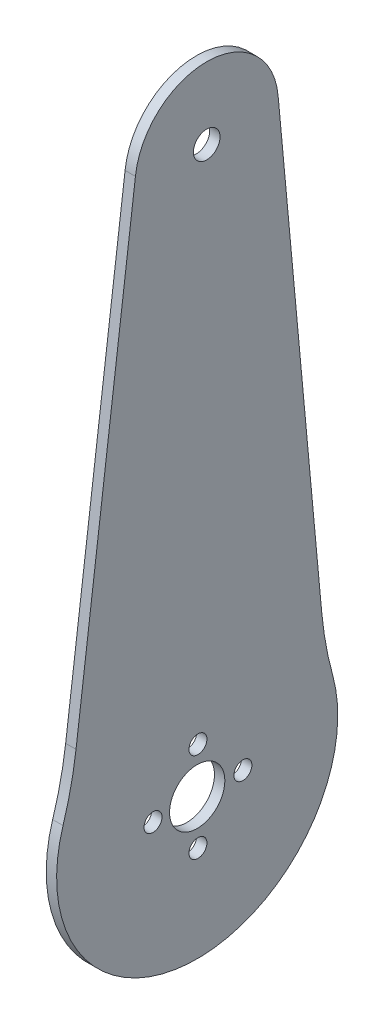
ISO-10303-21;
HEADER;
FILE_DESCRIPTION(('STEP AP214'),'2;1');
FILE_NAME('part.step','',(''),(''),'','','');
FILE_SCHEMA(('AUTOMOTIVE_DESIGN { 1 0 10303 214 1 1 1 1 }'));
ENDSEC;
DATA;
#1=APPLICATION_CONTEXT('core data for automotive mechanical design processes');
#2=APPLICATION_PROTOCOL_DEFINITION('international standard','automotive_design',2000,#1);
#3=PRODUCT_CONTEXT('',#1,'mechanical');
#4=PRODUCT('Part','Part','',(#3));
#5=PRODUCT_RELATED_PRODUCT_CATEGORY('part','',(#4));
#6=PRODUCT_DEFINITION_FORMATION('','',#4);
#7=PRODUCT_DEFINITION_CONTEXT('part definition',#1,'design');
#8=PRODUCT_DEFINITION('design','',#6,#7);
#9=PRODUCT_DEFINITION_SHAPE('','',#8);
#10=(LENGTH_UNIT() NAMED_UNIT(*) SI_UNIT(.MILLI.,.METRE.));
#11=(NAMED_UNIT(*) PLANE_ANGLE_UNIT() SI_UNIT($,.RADIAN.));
#12=(NAMED_UNIT(*) SI_UNIT($,.STERADIAN.) SOLID_ANGLE_UNIT());
#13=UNCERTAINTY_MEASURE_WITH_UNIT(LENGTH_MEASURE(1.E-05),#10,'distance_accuracy_value','');
#14=(GEOMETRIC_REPRESENTATION_CONTEXT(3) GLOBAL_UNCERTAINTY_ASSIGNED_CONTEXT((#13)) GLOBAL_UNIT_ASSIGNED_CONTEXT((#10,
#11,#12)) REPRESENTATION_CONTEXT('',''));
#15=CARTESIAN_POINT('',(0.,0.,0.));
#16=DIRECTION('',(0.,0.,1.));
#17=DIRECTION('',(1.,0.,0.));
#18=AXIS2_PLACEMENT_3D('',#15,#16,#17);
#19=CARTESIAN_POINT('',(1.5,-14.5197265267647,67.1222965585789));
#20=DIRECTION('',(-1.,0.,0.));
#21=DIRECTION('',(0.,0.,1.));
#22=AXIS2_PLACEMENT_3D('',#19,#20,#21);
#23=CYLINDRICAL_SURFACE('',#22,50.);
#24=CARTESIAN_POINT('',(0.,-14.5197265267647,67.1222965585789));
#25=DIRECTION('',(1.,0.,0.));
#26=DIRECTION('',(0.,0.,-1.));
#27=AXIS2_PLACEMENT_3D('',#24,#25,#26);
#28=CIRCLE('',#27,50.);
#29=CARTESIAN_POINT('',(0.,-29.4464687082596,19.4023597622337));
#30=VERTEX_POINT('',#29);
#31=CARTESIAN_POINT('',(0.,-20.8371614377476,17.5230020460004));
#32=VERTEX_POINT('',#31);
#33=EDGE_CURVE('E135',#30,#32,#28,.T.);
#34=ORIENTED_EDGE('',*,*,#33,.F.);
#35=DIRECTION('',(-1.,0.,0.));
#36=VECTOR('',#35,1.);
#37=CARTESIAN_POINT('',(1.5,-29.4464687082596,19.4023597622337));
#38=LINE('',#37,#36);
#39=CARTESIAN_POINT('',(1.5,-29.4464687082596,19.4023597622337));
#40=VERTEX_POINT('',#39);
#41=EDGE_CURVE('E11',#40,#30,#38,.T.);
#42=ORIENTED_EDGE('',*,*,#41,.F.);
#43=CARTESIAN_POINT('',(1.5,-14.5197265267647,67.1222965585789));
#44=DIRECTION('',(1.,0.,0.));
#45=DIRECTION('',(0.,0.,-1.));
#46=AXIS2_PLACEMENT_3D('',#43,#44,#45);
#47=CIRCLE('',#46,50.);
#48=CARTESIAN_POINT('',(1.5,-20.8371614377476,17.5230020460004));
#49=VERTEX_POINT('',#48);
#50=EDGE_CURVE('E166',#40,#49,#47,.T.);
#51=ORIENTED_EDGE('',*,*,#50,.T.);
#52=DIRECTION('',(-1.,0.,0.));
#53=VECTOR('',#52,1.);
#54=CARTESIAN_POINT('',(1.5,-20.8371614377476,17.5230020460004));
#55=LINE('',#54,#53);
#56=EDGE_CURVE('E78',#49,#32,#55,.T.);
#57=ORIENTED_EDGE('',*,*,#56,.T.);
#58=EDGE_LOOP('',(#34,#42,#51,#57));
#59=FACE_BOUND('',#58,.T.);
#60=ADVANCED_FACE('F34',(#59),#23,.F.);
#61=CARTESIAN_POINT('',(1.5,-35.5155048664515,0.));
#62=DIRECTION('',(-1.,0.,0.));
#63=DIRECTION('',(0.,0.,1.));
#64=AXIS2_PLACEMENT_3D('',#61,#62,#63);
#65=CYLINDRICAL_SURFACE('',#64,20.3294063915449);
#66=CARTESIAN_POINT('',(0.,-35.5155048664515,0.));
#67=DIRECTION('',(1.,0.,0.));
#68=DIRECTION('',(0.,0.,-1.));
#69=AXIS2_PLACEMENT_3D('',#66,#67,#68);
#70=CIRCLE('',#69,20.3294063915449);
#71=CARTESIAN_POINT('',(0.,-30.1098500353034,-19.5975421948537));
#72=VERTEX_POINT('',#71);
#73=EDGE_CURVE('E138',#30,#72,#70,.T.);
#74=ORIENTED_EDGE('',*,*,#73,.T.);
#75=DIRECTION('',(-1.,0.,0.));
#76=VECTOR('',#75,1.);
#77=CARTESIAN_POINT('',(1.5,-30.1098500353034,-19.5975421948537));
#78=LINE('',#77,#76);
#79=CARTESIAN_POINT('',(1.5,-30.1098500353034,-19.5975421948537));
#80=VERTEX_POINT('',#79);
#81=EDGE_CURVE('E42',#80,#72,#78,.T.);
#82=ORIENTED_EDGE('',*,*,#81,.F.);
#83=CARTESIAN_POINT('',(1.5,-35.5155048664515,0.));
#84=DIRECTION('',(1.,0.,0.));
#85=DIRECTION('',(0.,0.,-1.));
#86=AXIS2_PLACEMENT_3D('',#83,#84,#85);
#87=CIRCLE('',#86,20.3294063915449);
#88=EDGE_CURVE('E112',#40,#80,#87,.T.);
#89=ORIENTED_EDGE('',*,*,#88,.F.);
#90=ORIENTED_EDGE('',*,*,#41,.T.);
#91=EDGE_LOOP('',(#74,#82,#89,#90));
#92=FACE_BOUND('',#91,.T.);
#93=ADVANCED_FACE('F175',(#92),#65,.T.);
#94=CARTESIAN_POINT('',(1.5,-16.8146885164819,-67.7975285038606));
#95=DIRECTION('',(-1.,0.,0.));
#96=DIRECTION('',(0.,0.,1.));
#97=AXIS2_PLACEMENT_3D('',#94,#95,#96);
#98=CYLINDRICAL_SURFACE('',#97,50.);
#99=CARTESIAN_POINT('',(0.,-16.8146885164819,-67.7975285038606));
#100=DIRECTION('',(1.,0.,0.));
#101=DIRECTION('',(0.,0.,-1.));
#102=AXIS2_PLACEMENT_3D('',#99,#100,#101);
#103=CIRCLE('',#102,50.);
#104=CARTESIAN_POINT('',(0.,-21.4416066730812,-18.0120725114512));
#105=VERTEX_POINT('',#104);
#106=EDGE_CURVE('E141',#105,#72,#103,.T.);
#107=ORIENTED_EDGE('',*,*,#106,.F.);
#108=DIRECTION('',(-1.,0.,0.));
#109=VECTOR('',#108,1.);
#110=CARTESIAN_POINT('',(1.5,-21.4416066730812,-18.0120725114512));
#111=LINE('',#110,#109);
#112=CARTESIAN_POINT('',(1.5,-21.4416066730812,-18.0120725114512));
#113=VERTEX_POINT('',#112);
#114=EDGE_CURVE('E100',#113,#105,#111,.T.);
#115=ORIENTED_EDGE('',*,*,#114,.F.);
#116=CARTESIAN_POINT('',(1.5,-16.8146885164819,-67.7975285038606));
#117=DIRECTION('',(1.,0.,0.));
#118=DIRECTION('',(0.,0.,-1.));
#119=AXIS2_PLACEMENT_3D('',#116,#117,#118);
#120=CIRCLE('',#119,50.);
#121=EDGE_CURVE('E110',#113,#80,#120,.T.);
#122=ORIENTED_EDGE('',*,*,#121,.T.);
#123=ORIENTED_EDGE('',*,*,#81,.T.);
#124=EDGE_LOOP('',(#107,#115,#122,#123));
#125=FACE_BOUND('',#124,.T.);
#126=ADVANCED_FACE('F172',(#125),#98,.F.);
#127=CARTESIAN_POINT('',(1.5,1.47604368113649,-15.8821715109111));
#128=DIRECTION('',(0.,0.0925383631320308,-0.995709119848184));
#129=DIRECTION('',(0.,0.995709119848184,0.0925383631320308));
#130=AXIS2_PLACEMENT_3D('',#127,#128,#129);
#131=PLANE('',#130);
#132=DIRECTION('',(0.,-0.995709119848184,-0.0925383631320308));
#133=VECTOR('',#132,1.);
#134=CARTESIAN_POINT('',(0.,1.47604368113649,-15.8821715109111));
#135=LINE('',#134,#133);
#136=CARTESIAN_POINT('',(0.,46.2767379118723,-11.7185228823609));
#137=VERTEX_POINT('',#136);
#138=EDGE_CURVE('E99',#137,#105,#135,.T.);
#139=ORIENTED_EDGE('',*,*,#138,.F.);
#140=DIRECTION('',(-1.,0.,0.));
#141=VECTOR('',#140,1.);
#142=CARTESIAN_POINT('',(1.5,46.2767379118723,-11.7185228823609));
#143=LINE('',#142,#141);
#144=CARTESIAN_POINT('',(1.5,46.2767379118723,-11.7185228823609));
#145=VERTEX_POINT('',#144);
#146=EDGE_CURVE('E93',#145,#137,#143,.T.);
#147=ORIENTED_EDGE('',*,*,#146,.F.);
#148=DIRECTION('',(0.,-0.995709119848184,-0.0925383631320308));
#149=VECTOR('',#148,1.);
#150=CARTESIAN_POINT('',(1.5,1.47604368113649,-15.8821715109111));
#151=LINE('',#150,#149);
#152=EDGE_CURVE('E97',#145,#113,#151,.T.);
#153=ORIENTED_EDGE('',*,*,#152,.T.);
#154=ORIENTED_EDGE('',*,*,#114,.T.);
#155=EDGE_LOOP('',(#139,#147,#153,#154));
#156=FACE_BOUND('',#155,.T.);
#157=ADVANCED_FACE('F95',(#156),#131,.T.);
#158=CARTESIAN_POINT('',(1.5,45.4727796491909,-1.37759617231686));
#159=DIRECTION('',(-1.,0.,0.));
#160=DIRECTION('',(0.,0.,1.));
#161=AXIS2_PLACEMENT_3D('',#158,#159,#160);
#162=CYLINDRICAL_SURFACE('',#161,10.3721316088178);
#163=CARTESIAN_POINT('',(0.,45.4727796491909,-1.37759617231686));
#164=DIRECTION('',(1.,0.,0.));
#165=DIRECTION('',(0.,0.,-1.));
#166=AXIS2_PLACEMENT_3D('',#163,#164,#165);
#167=CIRCLE('',#166,10.3721316088178);
#168=CARTESIAN_POINT('',(0.,46.6279656765947,8.93000584525882));
#169=VERTEX_POINT('',#168);
#170=EDGE_CURVE('E71',#137,#169,#167,.T.);
#171=ORIENTED_EDGE('',*,*,#170,.T.);
#172=DIRECTION('',(-1.,0.,0.));
#173=VECTOR('',#172,1.);
#174=CARTESIAN_POINT('',(1.5,46.6279656765947,8.93000584525882));
#175=LINE('',#174,#173);
#176=CARTESIAN_POINT('',(1.5,46.6279656765947,8.93000584525882));
#177=VERTEX_POINT('',#176);
#178=EDGE_CURVE('E101',#177,#169,#175,.T.);
#179=ORIENTED_EDGE('',*,*,#178,.F.);
#180=CARTESIAN_POINT('',(1.5,45.4727796491909,-1.37759617231686));
#181=DIRECTION('',(1.,0.,0.));
#182=DIRECTION('',(0.,0.,-1.));
#183=AXIS2_PLACEMENT_3D('',#180,#181,#182);
#184=CIRCLE('',#183,10.3721316088178);
#185=EDGE_CURVE('E103',#145,#177,#184,.T.);
#186=ORIENTED_EDGE('',*,*,#185,.F.);
#187=ORIENTED_EDGE('',*,*,#146,.T.);
#188=EDGE_LOOP('',(#171,#179,#186,#187));
#189=FACE_BOUND('',#188,.T.);
#190=ADVANCED_FACE('F104',(#189),#162,.T.);
#191=CARTESIAN_POINT('',(1.5,-35.5155048664515,-6.61151934335853));
#192=DIRECTION('',(-1.,0.,0.));
#193=DIRECTION('',(0.,0.,1.));
#194=AXIS2_PLACEMENT_3D('',#191,#192,#193);
#195=CYLINDRICAL_SURFACE('',#194,1.3);
#196=CARTESIAN_POINT('',(1.5,-35.5155048664515,-6.61151934335853));
#197=DIRECTION('',(1.,0.,0.));
#198=DIRECTION('',(0.,0.,-1.));
#199=AXIS2_PLACEMENT_3D('',#196,#197,#198);
#200=CIRCLE('',#199,1.3);
#201=CARTESIAN_POINT('',(1.5,-35.5155048664515,-7.91151934335853));
#202=VERTEX_POINT('',#201);
#203=EDGE_CURVE('E129',#202,#202,#200,.T.);
#204=ORIENTED_EDGE('',*,*,#203,.T.);
#205=EDGE_LOOP('',(#204));
#206=FACE_BOUND('',#205,.T.);
#207=CARTESIAN_POINT('',(0.,-35.5155048664515,-6.61151934335853));
#208=DIRECTION('',(1.,0.,0.));
#209=DIRECTION('',(0.,0.,-1.));
#210=AXIS2_PLACEMENT_3D('',#207,#208,#209);
#211=CIRCLE('',#210,1.3);
#212=CARTESIAN_POINT('',(0.,-35.5155048664515,-7.91151934335853));
#213=VERTEX_POINT('',#212);
#214=EDGE_CURVE('E160',#213,#213,#211,.T.);
#215=ORIENTED_EDGE('',*,*,#214,.F.);
#216=EDGE_LOOP('',(#215));
#217=FACE_BOUND('',#216,.T.);
#218=ADVANCED_FACE('F196',(#206,#217),#195,.F.);
#219=CARTESIAN_POINT('',(1.5,-35.5155048664515,0.));
#220=DIRECTION('',(-1.,0.,0.));
#221=DIRECTION('',(0.,0.,1.));
#222=AXIS2_PLACEMENT_3D('',#219,#220,#221);
#223=CYLINDRICAL_SURFACE('',#222,4.);
#224=CARTESIAN_POINT('',(1.5,-35.5155048664515,0.));
#225=DIRECTION('',(1.,0.,0.));
#226=DIRECTION('',(0.,0.,-1.));
#227=AXIS2_PLACEMENT_3D('',#224,#225,#226);
#228=CIRCLE('',#227,4.);
#229=CARTESIAN_POINT('',(1.5,-35.5155048664515,-4.));
#230=VERTEX_POINT('',#229);
#231=EDGE_CURVE('E126',#230,#230,#228,.T.);
#232=ORIENTED_EDGE('',*,*,#231,.T.);
#233=EDGE_LOOP('',(#232));
#234=FACE_BOUND('',#233,.T.);
#235=CARTESIAN_POINT('',(0.,-35.5155048664515,0.));
#236=DIRECTION('',(1.,0.,0.));
#237=DIRECTION('',(0.,0.,-1.));
#238=AXIS2_PLACEMENT_3D('',#235,#236,#237);
#239=CIRCLE('',#238,4.);
#240=CARTESIAN_POINT('',(0.,-35.5155048664515,-4.));
#241=VERTEX_POINT('',#240);
#242=EDGE_CURVE('E157',#241,#241,#239,.T.);
#243=ORIENTED_EDGE('',*,*,#242,.F.);
#244=EDGE_LOOP('',(#243));
#245=FACE_BOUND('',#244,.T.);
#246=ADVANCED_FACE('F211',(#234,#245),#223,.F.);
#247=CARTESIAN_POINT('',(1.5,-35.5155048664515,6.38848065664147));
#248=DIRECTION('',(-1.,0.,0.));
#249=DIRECTION('',(0.,0.,1.));
#250=AXIS2_PLACEMENT_3D('',#247,#248,#249);
#251=CYLINDRICAL_SURFACE('',#250,1.3);
#252=CARTESIAN_POINT('',(1.5,-35.5155048664515,6.38848065664147));
#253=DIRECTION('',(1.,0.,0.));
#254=DIRECTION('',(0.,0.,-1.));
#255=AXIS2_PLACEMENT_3D('',#252,#253,#254);
#256=CIRCLE('',#255,1.3);
#257=CARTESIAN_POINT('',(1.5,-35.5155048664515,5.08848065664146));
#258=VERTEX_POINT('',#257);
#259=EDGE_CURVE('E123',#258,#258,#256,.T.);
#260=ORIENTED_EDGE('',*,*,#259,.T.);
#261=EDGE_LOOP('',(#260));
#262=FACE_BOUND('',#261,.T.);
#263=CARTESIAN_POINT('',(0.,-35.5155048664515,6.38848065664147));
#264=DIRECTION('',(1.,0.,0.));
#265=DIRECTION('',(0.,0.,-1.));
#266=AXIS2_PLACEMENT_3D('',#263,#264,#265);
#267=CIRCLE('',#266,1.3);
#268=CARTESIAN_POINT('',(0.,-35.5155048664515,5.08848065664146));
#269=VERTEX_POINT('',#268);
#270=EDGE_CURVE('E154',#269,#269,#267,.T.);
#271=ORIENTED_EDGE('',*,*,#270,.F.);
#272=EDGE_LOOP('',(#271));
#273=FACE_BOUND('',#272,.T.);
#274=ADVANCED_FACE('F207',(#262,#273),#251,.F.);
#275=CARTESIAN_POINT('',(1.5,-29.0155048664515,-0.11151934335852));
#276=DIRECTION('',(-1.,0.,0.));
#277=DIRECTION('',(0.,0.,1.));
#278=AXIS2_PLACEMENT_3D('',#275,#276,#277);
#279=CYLINDRICAL_SURFACE('',#278,1.3);
#280=CARTESIAN_POINT('',(1.5,-29.0155048664515,-0.11151934335852));
#281=DIRECTION('',(1.,0.,0.));
#282=DIRECTION('',(0.,0.,-1.));
#283=AXIS2_PLACEMENT_3D('',#280,#281,#282);
#284=CIRCLE('',#283,1.3);
#285=CARTESIAN_POINT('',(1.5,-29.0155048664515,-1.41151934335852));
#286=VERTEX_POINT('',#285);
#287=EDGE_CURVE('E120',#286,#286,#284,.F.);
#288=ORIENTED_EDGE('',*,*,#287,.F.);
#289=EDGE_LOOP('',(#288));
#290=FACE_BOUND('',#289,.T.);
#291=CARTESIAN_POINT('',(0.,-29.0155048664515,-0.11151934335852));
#292=DIRECTION('',(1.,0.,0.));
#293=DIRECTION('',(0.,0.,-1.));
#294=AXIS2_PLACEMENT_3D('',#291,#292,#293);
#295=CIRCLE('',#294,1.3);
#296=CARTESIAN_POINT('',(0.,-29.0155048664515,-1.41151934335852));
#297=VERTEX_POINT('',#296);
#298=EDGE_CURVE('E151',#297,#297,#295,.F.);
#299=ORIENTED_EDGE('',*,*,#298,.T.);
#300=EDGE_LOOP('',(#299));
#301=FACE_BOUND('',#300,.T.);
#302=ADVANCED_FACE('F203',(#290,#301),#279,.F.);
#303=CARTESIAN_POINT('',(1.5,45.4727796491909,-1.37759617231686));
#304=DIRECTION('',(-1.,0.,0.));
#305=DIRECTION('',(0.,0.,1.));
#306=AXIS2_PLACEMENT_3D('',#303,#304,#305);
#307=CYLINDRICAL_SURFACE('',#306,1.92500000001123);
#308=CARTESIAN_POINT('',(1.5,45.4727796491909,-1.37759617231686));
#309=DIRECTION('',(1.,0.,0.));
#310=DIRECTION('',(0.,0.,-1.));
#311=AXIS2_PLACEMENT_3D('',#308,#309,#310);
#312=CIRCLE('',#311,1.92500000001123);
#313=CARTESIAN_POINT('',(1.5,45.4727796491909,-3.30259617232809));
#314=VERTEX_POINT('',#313);
#315=EDGE_CURVE('E117',#314,#314,#312,.T.);
#316=ORIENTED_EDGE('',*,*,#315,.T.);
#317=EDGE_LOOP('',(#316));
#318=FACE_BOUND('',#317,.T.);
#319=CARTESIAN_POINT('',(0.,45.4727796491909,-1.37759617231686));
#320=DIRECTION('',(1.,0.,0.));
#321=DIRECTION('',(0.,0.,-1.));
#322=AXIS2_PLACEMENT_3D('',#319,#320,#321);
#323=CIRCLE('',#322,1.92500000001123);
#324=CARTESIAN_POINT('',(0.,45.4727796491909,-3.30259617232809));
#325=VERTEX_POINT('',#324);
#326=EDGE_CURVE('E148',#325,#325,#323,.T.);
#327=ORIENTED_EDGE('',*,*,#326,.F.);
#328=EDGE_LOOP('',(#327));
#329=FACE_BOUND('',#328,.T.);
#330=ADVANCED_FACE('F200',(#318,#329),#307,.F.);
#331=CARTESIAN_POINT('',(1.5,1.86362087970866,14.6316158654459));
#332=DIRECTION('',(0.,-0.12634869821966,-0.991985890251569));
#333=DIRECTION('',(0.,0.991985890251569,-0.12634869821966));
#334=AXIS2_PLACEMENT_3D('',#331,#332,#333);
#335=PLANE('',#334);
#336=DIRECTION('',(0.,-0.991985890251569,0.12634869821966));
#337=VECTOR('',#336,1.);
#338=CARTESIAN_POINT('',(0.,1.86362087970866,14.6316158654459));
#339=LINE('',#338,#337);
#340=EDGE_CURVE('E146',#169,#32,#339,.T.);
#341=ORIENTED_EDGE('',*,*,#340,.T.);
#342=ORIENTED_EDGE('',*,*,#56,.F.);
#343=DIRECTION('',(0.,-0.991985890251569,0.12634869821966));
#344=VECTOR('',#343,1.);
#345=CARTESIAN_POINT('',(1.5,1.86362087970866,14.6316158654459));
#346=LINE('',#345,#344);
#347=EDGE_CURVE('E50',#177,#49,#346,.T.);
#348=ORIENTED_EDGE('',*,*,#347,.F.);
#349=ORIENTED_EDGE('',*,*,#178,.T.);
#350=EDGE_LOOP('',(#341,#342,#348,#349));
#351=FACE_BOUND('',#350,.T.);
#352=ADVANCED_FACE('F181',(#351),#335,.F.);
#353=CARTESIAN_POINT('',(1.5,-42.0155048664515,-0.111519343358546));
#354=DIRECTION('',(-1.,0.,0.));
#355=DIRECTION('',(0.,0.,1.));
#356=AXIS2_PLACEMENT_3D('',#353,#354,#355);
#357=CYLINDRICAL_SURFACE('',#356,1.3);
#358=CARTESIAN_POINT('',(1.5,-42.0155048664515,-0.111519343358546));
#359=DIRECTION('',(1.,0.,0.));
#360=DIRECTION('',(0.,0.,-1.));
#361=AXIS2_PLACEMENT_3D('',#358,#359,#360);
#362=CIRCLE('',#361,1.3);
#363=CARTESIAN_POINT('',(1.5,-42.0155048664515,-1.41151934335855));
#364=VERTEX_POINT('',#363);
#365=EDGE_CURVE('E132',#364,#364,#362,.F.);
#366=ORIENTED_EDGE('',*,*,#365,.F.);
#367=EDGE_LOOP('',(#366));
#368=FACE_BOUND('',#367,.T.);
#369=CARTESIAN_POINT('',(0.,-42.0155048664515,-0.111519343358546));
#370=DIRECTION('',(1.,0.,0.));
#371=DIRECTION('',(0.,0.,-1.));
#372=AXIS2_PLACEMENT_3D('',#369,#370,#371);
#373=CIRCLE('',#372,1.3);
#374=CARTESIAN_POINT('',(0.,-42.0155048664515,-1.41151934335855));
#375=VERTEX_POINT('',#374);
#376=EDGE_CURVE('E163',#375,#375,#373,.F.);
#377=ORIENTED_EDGE('',*,*,#376,.T.);
#378=EDGE_LOOP('',(#377));
#379=FACE_BOUND('',#378,.T.);
#380=ADVANCED_FACE('F199',(#368,#379),#357,.F.);
#381=CARTESIAN_POINT('',(1.5,0.,0.));
#382=DIRECTION('',(1.,0.,0.));
#383=DIRECTION('',(0.,0.,-1.));
#384=AXIS2_PLACEMENT_3D('',#381,#382,#383);
#385=PLANE('',#384);
#386=ORIENTED_EDGE('',*,*,#50,.F.);
#387=ORIENTED_EDGE('',*,*,#88,.T.);
#388=ORIENTED_EDGE('',*,*,#121,.F.);
#389=ORIENTED_EDGE('',*,*,#152,.F.);
#390=ORIENTED_EDGE('',*,*,#185,.T.);
#391=ORIENTED_EDGE('',*,*,#347,.T.);
#392=EDGE_LOOP('',(#386,#387,#388,#389,#390,#391));
#393=FACE_BOUND('',#392,.T.);
#394=ORIENTED_EDGE('',*,*,#315,.F.);
#395=EDGE_LOOP('',(#394));
#396=FACE_BOUND('',#395,.T.);
#397=ORIENTED_EDGE('',*,*,#287,.T.);
#398=EDGE_LOOP('',(#397));
#399=FACE_BOUND('',#398,.T.);
#400=ORIENTED_EDGE('',*,*,#259,.F.);
#401=EDGE_LOOP('',(#400));
#402=FACE_BOUND('',#401,.T.);
#403=ORIENTED_EDGE('',*,*,#231,.F.);
#404=EDGE_LOOP('',(#403));
#405=FACE_BOUND('',#404,.T.);
#406=ORIENTED_EDGE('',*,*,#203,.F.);
#407=EDGE_LOOP('',(#406));
#408=FACE_BOUND('',#407,.T.);
#409=ORIENTED_EDGE('',*,*,#365,.T.);
#410=EDGE_LOOP('',(#409));
#411=FACE_BOUND('',#410,.T.);
#412=ADVANCED_FACE('F107',(#393,#396,#399,#402,#405,#408,#411),#385,.T.);
#413=CARTESIAN_POINT('',(0.,0.,0.));
#414=DIRECTION('',(1.,0.,0.));
#415=DIRECTION('',(0.,0.,-1.));
#416=AXIS2_PLACEMENT_3D('',#413,#414,#415);
#417=PLANE('',#416);
#418=ORIENTED_EDGE('',*,*,#33,.T.);
#419=ORIENTED_EDGE('',*,*,#340,.F.);
#420=ORIENTED_EDGE('',*,*,#170,.F.);
#421=ORIENTED_EDGE('',*,*,#138,.T.);
#422=ORIENTED_EDGE('',*,*,#106,.T.);
#423=ORIENTED_EDGE('',*,*,#73,.F.);
#424=EDGE_LOOP('',(#418,#419,#420,#421,#422,#423));
#425=FACE_BOUND('',#424,.T.);
#426=ORIENTED_EDGE('',*,*,#326,.T.);
#427=EDGE_LOOP('',(#426));
#428=FACE_BOUND('',#427,.T.);
#429=ORIENTED_EDGE('',*,*,#298,.F.);
#430=EDGE_LOOP('',(#429));
#431=FACE_BOUND('',#430,.T.);
#432=ORIENTED_EDGE('',*,*,#270,.T.);
#433=EDGE_LOOP('',(#432));
#434=FACE_BOUND('',#433,.T.);
#435=ORIENTED_EDGE('',*,*,#242,.T.);
#436=EDGE_LOOP('',(#435));
#437=FACE_BOUND('',#436,.T.);
#438=ORIENTED_EDGE('',*,*,#214,.T.);
#439=EDGE_LOOP('',(#438));
#440=FACE_BOUND('',#439,.T.);
#441=ORIENTED_EDGE('',*,*,#376,.F.);
#442=EDGE_LOOP('',(#441));
#443=FACE_BOUND('',#442,.T.);
#444=ADVANCED_FACE('F177',(#425,#428,#431,#434,#437,#440,#443),#417,.F.);
#445=CLOSED_SHELL('',(#60,#93,#126,#157,#190,#218,#246,#274,#302,#330,#352,#380,#412,#444));
#446=MANIFOLD_SOLID_BREP('B2',#445);
#447=ADVANCED_BREP_SHAPE_REPRESENTATION('',(#18,#446),#14);
#448=SHAPE_DEFINITION_REPRESENTATION(#9,#447);
ENDSEC;
END-ISO-10303-21;
